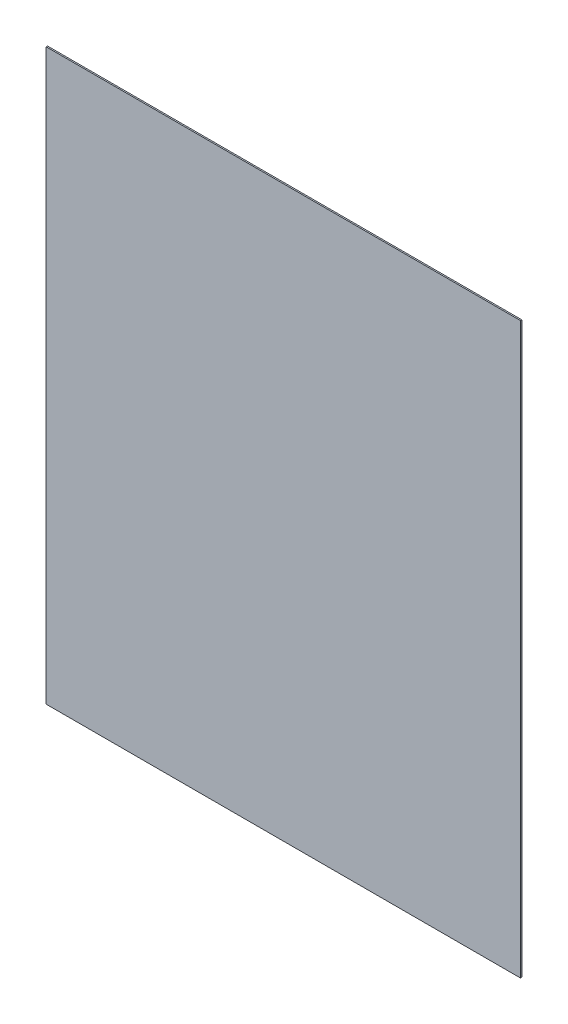
ISO-10303-21;
HEADER;
FILE_DESCRIPTION(('STEP AP214'),'2;1');
FILE_NAME('part.step','',(''),(''),'','','');
FILE_SCHEMA(('AUTOMOTIVE_DESIGN { 1 0 10303 214 1 1 1 1 }'));
ENDSEC;
DATA;
#1=APPLICATION_CONTEXT('core data for automotive mechanical design processes');
#2=APPLICATION_PROTOCOL_DEFINITION('international standard','automotive_design',2000,#1);
#3=PRODUCT_CONTEXT('',#1,'mechanical');
#4=PRODUCT('Part','Part','',(#3));
#5=PRODUCT_RELATED_PRODUCT_CATEGORY('part','',(#4));
#6=PRODUCT_DEFINITION_FORMATION('','',#4);
#7=PRODUCT_DEFINITION_CONTEXT('part definition',#1,'design');
#8=PRODUCT_DEFINITION('design','',#6,#7);
#9=PRODUCT_DEFINITION_SHAPE('','',#8);
#10=(LENGTH_UNIT() NAMED_UNIT(*) SI_UNIT(.MILLI.,.METRE.));
#11=(NAMED_UNIT(*) PLANE_ANGLE_UNIT() SI_UNIT($,.RADIAN.));
#12=(NAMED_UNIT(*) SI_UNIT($,.STERADIAN.) SOLID_ANGLE_UNIT());
#13=UNCERTAINTY_MEASURE_WITH_UNIT(LENGTH_MEASURE(1.E-05),#10,'distance_accuracy_value','');
#14=(GEOMETRIC_REPRESENTATION_CONTEXT(3) GLOBAL_UNCERTAINTY_ASSIGNED_CONTEXT((#13)) GLOBAL_UNIT_ASSIGNED_CONTEXT((#10,
#11,#12)) REPRESENTATION_CONTEXT('',''));
#15=CARTESIAN_POINT('',(0.,0.,0.));
#16=DIRECTION('',(0.,0.,1.));
#17=DIRECTION('',(1.,0.,0.));
#18=AXIS2_PLACEMENT_3D('',#15,#16,#17);
#19=CARTESIAN_POINT('',(0.,0.,0.));
#20=DIRECTION('',(0.,0.,-1.));
#21=DIRECTION('',(-1.,0.,0.));
#22=AXIS2_PLACEMENT_3D('',#19,#20,#21);
#23=PLANE('',#22);
#24=DIRECTION('',(0.,-1.,0.));
#25=VECTOR('',#24,1.);
#26=CARTESIAN_POINT('',(6.98000000107208,8.38000000170986,0.));
#27=LINE('',#26,#25);
#28=CARTESIAN_POINT('',(6.98000000107208,8.38000000170986,0.));
#29=VERTEX_POINT('',#28);
#30=CARTESIAN_POINT('',(6.98000000107195,0.,0.));
#31=VERTEX_POINT('',#30);
#32=EDGE_CURVE('E55',#29,#31,#27,.T.);
#33=ORIENTED_EDGE('',*,*,#32,.T.);
#34=DIRECTION('',(-1.,0.,0.));
#35=VECTOR('',#34,1.);
#36=CARTESIAN_POINT('',(6.98000000107191,0.,0.));
#37=LINE('',#36,#35);
#38=CARTESIAN_POINT('',(0.,0.,0.));
#39=VERTEX_POINT('',#38);
#40=EDGE_CURVE('E76',#31,#39,#37,.T.);
#41=ORIENTED_EDGE('',*,*,#40,.T.);
#42=DIRECTION('',(0.,1.,0.));
#43=VECTOR('',#42,1.);
#44=CARTESIAN_POINT('',(0.,0.,0.));
#45=LINE('',#44,#43);
#46=CARTESIAN_POINT('',(1.1539214028744E-13,8.38000000170986,0.));
#47=VERTEX_POINT('',#46);
#48=EDGE_CURVE('E58',#39,#47,#45,.T.);
#49=ORIENTED_EDGE('',*,*,#48,.T.);
#50=DIRECTION('',(1.,0.,0.));
#51=VECTOR('',#50,1.);
#52=CARTESIAN_POINT('',(1.53704604599625E-13,8.38000000170986,0.));
#53=LINE('',#52,#51);
#54=EDGE_CURVE('E20',#47,#29,#53,.T.);
#55=ORIENTED_EDGE('',*,*,#54,.T.);
#56=EDGE_LOOP('',(#33,#41,#49,#55));
#57=FACE_BOUND('',#56,.T.);
#58=ADVANCED_FACE('F17',(#57),#23,.T.);
#59=CARTESIAN_POINT('',(1.53704604599625E-13,8.38000000170986,0.02));
#60=DIRECTION('',(0.,-1.,0.));
#61=DIRECTION('',(0.,0.,-1.));
#62=AXIS2_PLACEMENT_3D('',#59,#60,#61);
#63=PLANE('',#62);
#64=DIRECTION('',(0.,0.,1.));
#65=VECTOR('',#64,1.);
#66=CARTESIAN_POINT('',(1.53704604599625E-13,8.38000000170986,0.02));
#67=LINE('',#66,#65);
#68=CARTESIAN_POINT('',(1.1539214028744E-13,8.38000000170986,0.02));
#69=VERTEX_POINT('',#68);
#70=EDGE_CURVE('E78',#47,#69,#67,.T.);
#71=ORIENTED_EDGE('',*,*,#70,.T.);
#72=DIRECTION('',(-1.,0.,0.));
#73=VECTOR('',#72,1.);
#74=CARTESIAN_POINT('',(0.,8.38000000170986,0.02));
#75=LINE('',#74,#73);
#76=CARTESIAN_POINT('',(6.98000000107208,8.38000000170986,0.02));
#77=VERTEX_POINT('',#76);
#78=EDGE_CURVE('E73',#69,#77,#75,.F.);
#79=ORIENTED_EDGE('',*,*,#78,.T.);
#80=DIRECTION('',(0.,0.,1.));
#81=VECTOR('',#80,1.);
#82=CARTESIAN_POINT('',(6.98000000107208,8.38000000170986,0.02));
#83=LINE('',#82,#81);
#84=EDGE_CURVE('E63',#77,#29,#83,.F.);
#85=ORIENTED_EDGE('',*,*,#84,.T.);
#86=ORIENTED_EDGE('',*,*,#54,.F.);
#87=EDGE_LOOP('',(#71,#79,#85,#86));
#88=FACE_BOUND('',#87,.T.);
#89=ADVANCED_FACE('F72',(#88),#63,.F.);
#90=CARTESIAN_POINT('',(6.98000000107208,8.38000000170986,0.02));
#91=DIRECTION('',(-1.,0.,0.));
#92=DIRECTION('',(0.,-1.,0.));
#93=AXIS2_PLACEMENT_3D('',#90,#91,#92);
#94=PLANE('',#93);
#95=ORIENTED_EDGE('',*,*,#84,.F.);
#96=DIRECTION('',(0.,1.,0.));
#97=VECTOR('',#96,1.);
#98=CARTESIAN_POINT('',(6.98000000107208,0.,0.02));
#99=LINE('',#98,#97);
#100=CARTESIAN_POINT('',(6.98000000107195,0.,0.02));
#101=VERTEX_POINT('',#100);
#102=EDGE_CURVE('E83',#77,#101,#99,.F.);
#103=ORIENTED_EDGE('',*,*,#102,.T.);
#104=DIRECTION('',(0.,0.,1.));
#105=VECTOR('',#104,1.);
#106=CARTESIAN_POINT('',(6.98000000107191,0.,0.02));
#107=LINE('',#106,#105);
#108=EDGE_CURVE('E69',#101,#31,#107,.F.);
#109=ORIENTED_EDGE('',*,*,#108,.T.);
#110=ORIENTED_EDGE('',*,*,#32,.F.);
#111=EDGE_LOOP('',(#95,#103,#109,#110));
#112=FACE_BOUND('',#111,.T.);
#113=ADVANCED_FACE('F66',(#112),#94,.F.);
#114=CARTESIAN_POINT('',(6.98000000107191,0.,0.02));
#115=DIRECTION('',(0.,1.,0.));
#116=DIRECTION('',(-1.,0.,0.));
#117=AXIS2_PLACEMENT_3D('',#114,#115,#116);
#118=PLANE('',#117);
#119=ORIENTED_EDGE('',*,*,#108,.F.);
#120=DIRECTION('',(-1.,0.,0.));
#121=VECTOR('',#120,1.);
#122=CARTESIAN_POINT('',(0.,0.,0.02));
#123=LINE('',#122,#121);
#124=CARTESIAN_POINT('',(0.,0.,0.02));
#125=VERTEX_POINT('',#124);
#126=EDGE_CURVE('E26',#101,#125,#123,.T.);
#127=ORIENTED_EDGE('',*,*,#126,.T.);
#128=DIRECTION('',(0.,0.,1.));
#129=VECTOR('',#128,1.);
#130=CARTESIAN_POINT('',(0.,0.,0.02));
#131=LINE('',#130,#129);
#132=EDGE_CURVE('E34',#125,#39,#131,.F.);
#133=ORIENTED_EDGE('',*,*,#132,.T.);
#134=ORIENTED_EDGE('',*,*,#40,.F.);
#135=EDGE_LOOP('',(#119,#127,#133,#134));
#136=FACE_BOUND('',#135,.T.);
#137=ADVANCED_FACE('F88',(#136),#118,.F.);
#138=CARTESIAN_POINT('',(0.,0.,0.02));
#139=DIRECTION('',(1.,0.,0.));
#140=DIRECTION('',(0.,1.,0.));
#141=AXIS2_PLACEMENT_3D('',#138,#139,#140);
#142=PLANE('',#141);
#143=ORIENTED_EDGE('',*,*,#132,.F.);
#144=DIRECTION('',(0.,1.,0.));
#145=VECTOR('',#144,1.);
#146=CARTESIAN_POINT('',(0.,0.,0.02));
#147=LINE('',#146,#145);
#148=EDGE_CURVE('E11',#125,#69,#147,.T.);
#149=ORIENTED_EDGE('',*,*,#148,.T.);
#150=ORIENTED_EDGE('',*,*,#70,.F.);
#151=ORIENTED_EDGE('',*,*,#48,.F.);
#152=EDGE_LOOP('',(#143,#149,#150,#151));
#153=FACE_BOUND('',#152,.T.);
#154=ADVANCED_FACE('F91',(#153),#142,.F.);
#155=CARTESIAN_POINT('',(0.,0.,0.02));
#156=DIRECTION('',(0.,0.,-1.));
#157=DIRECTION('',(-1.,0.,0.));
#158=AXIS2_PLACEMENT_3D('',#155,#156,#157);
#159=PLANE('',#158);
#160=ORIENTED_EDGE('',*,*,#126,.F.);
#161=ORIENTED_EDGE('',*,*,#102,.F.);
#162=ORIENTED_EDGE('',*,*,#78,.F.);
#163=ORIENTED_EDGE('',*,*,#148,.F.);
#164=EDGE_LOOP('',(#160,#161,#162,#163));
#165=FACE_BOUND('',#164,.T.);
#166=ADVANCED_FACE('F90',(#165),#159,.F.);
#167=CLOSED_SHELL('',(#58,#89,#113,#137,#154,#166));
#168=MANIFOLD_SOLID_BREP('B1',#167);
#169=ADVANCED_BREP_SHAPE_REPRESENTATION('',(#18,#168),#14);
#170=SHAPE_DEFINITION_REPRESENTATION(#9,#169);
ENDSEC;
END-ISO-10303-21;
